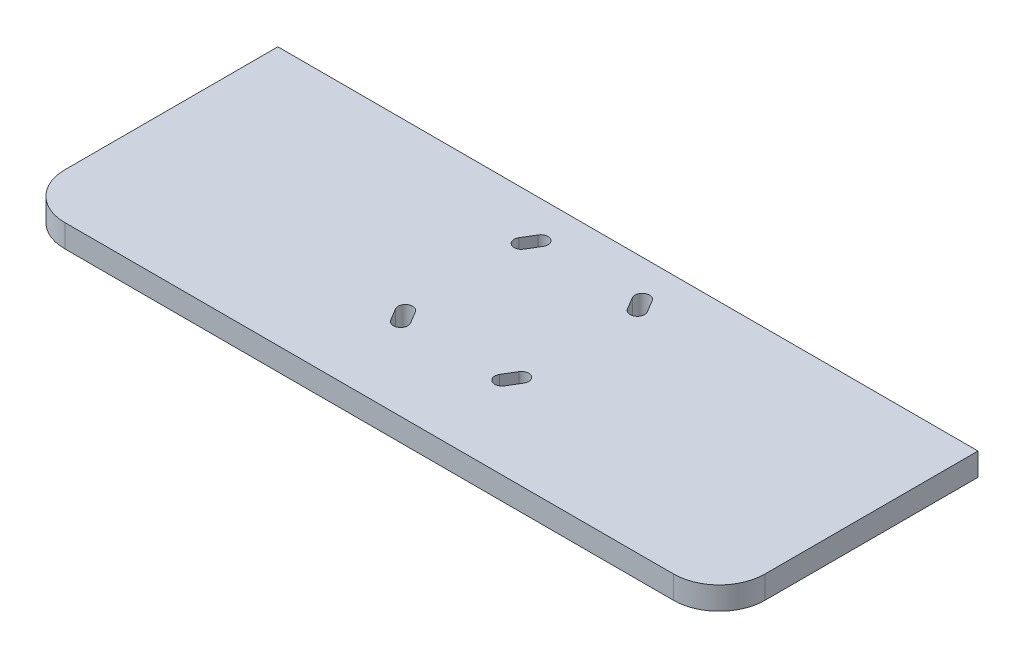
ISO-10303-21;
HEADER;
FILE_DESCRIPTION(('STEP AP214'),'2;1');
FILE_NAME('part.step','',(''),(''),'','','');
FILE_SCHEMA(('AUTOMOTIVE_DESIGN { 1 0 10303 214 1 1 1 1 }'));
ENDSEC;
DATA;
#1=APPLICATION_CONTEXT('core data for automotive mechanical design processes');
#2=APPLICATION_PROTOCOL_DEFINITION('international standard','automotive_design',2000,#1);
#3=PRODUCT_CONTEXT('',#1,'mechanical');
#4=PRODUCT('Part','Part','',(#3));
#5=PRODUCT_RELATED_PRODUCT_CATEGORY('part','',(#4));
#6=PRODUCT_DEFINITION_FORMATION('','',#4);
#7=PRODUCT_DEFINITION_CONTEXT('part definition',#1,'design');
#8=PRODUCT_DEFINITION('design','',#6,#7);
#9=PRODUCT_DEFINITION_SHAPE('','',#8);
#10=(LENGTH_UNIT() NAMED_UNIT(*) SI_UNIT(.MILLI.,.METRE.));
#11=(NAMED_UNIT(*) PLANE_ANGLE_UNIT() SI_UNIT($,.RADIAN.));
#12=(NAMED_UNIT(*) SI_UNIT($,.STERADIAN.) SOLID_ANGLE_UNIT());
#13=UNCERTAINTY_MEASURE_WITH_UNIT(LENGTH_MEASURE(1.E-05),#10,'distance_accuracy_value','');
#14=(GEOMETRIC_REPRESENTATION_CONTEXT(3) GLOBAL_UNCERTAINTY_ASSIGNED_CONTEXT((#13)) GLOBAL_UNIT_ASSIGNED_CONTEXT((#10,
#11,#12)) REPRESENTATION_CONTEXT('',''));
#15=CARTESIAN_POINT('',(0.,0.,0.));
#16=DIRECTION('',(0.,0.,1.));
#17=DIRECTION('',(1.,0.,0.));
#18=AXIS2_PLACEMENT_3D('',#15,#16,#17);
#19=CARTESIAN_POINT('',(230.,15.,70.));
#20=DIRECTION('',(-1.,0.,0.));
#21=DIRECTION('',(0.,0.,1.));
#22=AXIS2_PLACEMENT_3D('',#19,#20,#21);
#23=PLANE('',#22);
#24=DIRECTION('',(0.,0.,-1.));
#25=VECTOR('',#24,1.);
#26=CARTESIAN_POINT('',(230.,0.,70.));
#27=LINE('',#26,#25);
#28=CARTESIAN_POINT('',(230.,0.,70.));
#29=VERTEX_POINT('',#28);
#30=CARTESIAN_POINT('',(230.,0.,-70.));
#31=VERTEX_POINT('',#30);
#32=EDGE_CURVE('E201',#29,#31,#27,.T.);
#33=ORIENTED_EDGE('',*,*,#32,.T.);
#34=DIRECTION('',(0.,1.,0.));
#35=VECTOR('',#34,1.);
#36=CARTESIAN_POINT('',(230.,15.,-69.9999999999999));
#37=LINE('',#36,#35);
#38=CARTESIAN_POINT('',(230.,15.,-69.9999999999999));
#39=VERTEX_POINT('',#38);
#40=EDGE_CURVE('E49',#31,#39,#37,.T.);
#41=ORIENTED_EDGE('',*,*,#40,.T.);
#42=DIRECTION('',(0.,0.,-1.));
#43=VECTOR('',#42,1.);
#44=CARTESIAN_POINT('',(230.,15.,70.));
#45=LINE('',#44,#43);
#46=CARTESIAN_POINT('',(230.,15.,70.));
#47=VERTEX_POINT('',#46);
#48=EDGE_CURVE('E212',#47,#39,#45,.T.);
#49=ORIENTED_EDGE('',*,*,#48,.F.);
#50=DIRECTION('',(0.,-1.,0.));
#51=VECTOR('',#50,1.);
#52=CARTESIAN_POINT('',(230.,15.,70.));
#53=LINE('',#52,#51);
#54=EDGE_CURVE('E213',#47,#29,#53,.T.);
#55=ORIENTED_EDGE('',*,*,#54,.T.);
#56=EDGE_LOOP('',(#33,#41,#49,#55));
#57=FACE_BOUND('',#56,.T.);
#58=ADVANCED_FACE('F36',(#57),#23,.F.);
#59=CARTESIAN_POINT('',(-230.,15.,70.));
#60=DIRECTION('',(1.,0.,0.));
#61=DIRECTION('',(0.,0.,-1.));
#62=AXIS2_PLACEMENT_3D('',#59,#60,#61);
#63=PLANE('',#62);
#64=DIRECTION('',(0.,0.,1.));
#65=VECTOR('',#64,1.);
#66=CARTESIAN_POINT('',(-230.,15.,70.));
#67=LINE('',#66,#65);
#68=CARTESIAN_POINT('',(-230.,15.,-70.));
#69=VERTEX_POINT('',#68);
#70=CARTESIAN_POINT('',(-230.,15.,70.));
#71=VERTEX_POINT('',#70);
#72=EDGE_CURVE('E194',#69,#71,#67,.T.);
#73=ORIENTED_EDGE('',*,*,#72,.F.);
#74=DIRECTION('',(0.,-1.,0.));
#75=VECTOR('',#74,1.);
#76=CARTESIAN_POINT('',(-230.,15.,-70.));
#77=LINE('',#76,#75);
#78=CARTESIAN_POINT('',(-230.,0.,-70.));
#79=VERTEX_POINT('',#78);
#80=EDGE_CURVE('E182',#69,#79,#77,.T.);
#81=ORIENTED_EDGE('',*,*,#80,.T.);
#82=DIRECTION('',(0.,0.,1.));
#83=VECTOR('',#82,1.);
#84=CARTESIAN_POINT('',(-230.,0.,70.));
#85=LINE('',#84,#83);
#86=CARTESIAN_POINT('',(-230.,0.,70.));
#87=VERTEX_POINT('',#86);
#88=EDGE_CURVE('E192',#79,#87,#85,.T.);
#89=ORIENTED_EDGE('',*,*,#88,.T.);
#90=DIRECTION('',(0.,-1.,0.));
#91=VECTOR('',#90,1.);
#92=CARTESIAN_POINT('',(-230.,15.,70.));
#93=LINE('',#92,#91);
#94=EDGE_CURVE('E43',#71,#87,#93,.T.);
#95=ORIENTED_EDGE('',*,*,#94,.F.);
#96=EDGE_LOOP('',(#73,#81,#89,#95));
#97=FACE_BOUND('',#96,.T.);
#98=ADVANCED_FACE('F190',(#97),#63,.F.);
#99=CARTESIAN_POINT('',(-200.,15.,70.));
#100=DIRECTION('',(0.,-1.,0.));
#101=DIRECTION('',(0.,0.,-1.));
#102=AXIS2_PLACEMENT_3D('',#99,#100,#101);
#103=CYLINDRICAL_SURFACE('',#102,30.);
#104=CARTESIAN_POINT('',(-200.,0.,70.));
#105=DIRECTION('',(0.,1.,0.));
#106=DIRECTION('',(0.,0.,-1.));
#107=AXIS2_PLACEMENT_3D('',#104,#105,#106);
#108=CIRCLE('',#107,30.);
#109=CARTESIAN_POINT('',(-200.,0.,100.));
#110=VERTEX_POINT('',#109);
#111=EDGE_CURVE('E200',#87,#110,#108,.T.);
#112=ORIENTED_EDGE('',*,*,#111,.T.);
#113=DIRECTION('',(0.,-1.,0.));
#114=VECTOR('',#113,1.);
#115=CARTESIAN_POINT('',(-200.,15.,100.));
#116=LINE('',#115,#114);
#117=CARTESIAN_POINT('',(-200.,15.,100.));
#118=VERTEX_POINT('',#117);
#119=EDGE_CURVE('E220',#118,#110,#116,.T.);
#120=ORIENTED_EDGE('',*,*,#119,.F.);
#121=CARTESIAN_POINT('',(-200.,15.,70.));
#122=DIRECTION('',(0.,1.,0.));
#123=DIRECTION('',(0.,0.,-1.));
#124=AXIS2_PLACEMENT_3D('',#121,#122,#123);
#125=CIRCLE('',#124,30.);
#126=EDGE_CURVE('E226',#71,#118,#125,.T.);
#127=ORIENTED_EDGE('',*,*,#126,.F.);
#128=ORIENTED_EDGE('',*,*,#94,.T.);
#129=EDGE_LOOP('',(#112,#120,#127,#128));
#130=FACE_BOUND('',#129,.T.);
#131=ADVANCED_FACE('F224',(#130),#103,.T.);
#132=CARTESIAN_POINT('',(-200.,15.,100.));
#133=DIRECTION('',(0.,0.,-1.));
#134=DIRECTION('',(-1.,0.,0.));
#135=AXIS2_PLACEMENT_3D('',#132,#133,#134);
#136=PLANE('',#135);
#137=DIRECTION('',(1.,0.,0.));
#138=VECTOR('',#137,1.);
#139=CARTESIAN_POINT('',(-200.,0.,100.));
#140=LINE('',#139,#138);
#141=CARTESIAN_POINT('',(200.,0.,100.));
#142=VERTEX_POINT('',#141);
#143=EDGE_CURVE('E203',#110,#142,#140,.T.);
#144=ORIENTED_EDGE('',*,*,#143,.T.);
#145=DIRECTION('',(0.,-1.,0.));
#146=VECTOR('',#145,1.);
#147=CARTESIAN_POINT('',(200.,15.,100.));
#148=LINE('',#147,#146);
#149=CARTESIAN_POINT('',(200.,15.,100.));
#150=VERTEX_POINT('',#149);
#151=EDGE_CURVE('E216',#150,#142,#148,.T.);
#152=ORIENTED_EDGE('',*,*,#151,.F.);
#153=DIRECTION('',(1.,0.,0.));
#154=VECTOR('',#153,1.);
#155=CARTESIAN_POINT('',(-200.,15.,100.));
#156=LINE('',#155,#154);
#157=EDGE_CURVE('E229',#118,#150,#156,.T.);
#158=ORIENTED_EDGE('',*,*,#157,.F.);
#159=ORIENTED_EDGE('',*,*,#119,.T.);
#160=EDGE_LOOP('',(#144,#152,#158,#159));
#161=FACE_BOUND('',#160,.T.);
#162=ADVANCED_FACE('F430',(#161),#136,.F.);
#163=CARTESIAN_POINT('',(200.,15.,70.));
#164=DIRECTION('',(0.,-1.,0.));
#165=DIRECTION('',(0.,0.,-1.));
#166=AXIS2_PLACEMENT_3D('',#163,#164,#165);
#167=CYLINDRICAL_SURFACE('',#166,30.);
#168=CARTESIAN_POINT('',(200.,0.,70.));
#169=DIRECTION('',(0.,1.,0.));
#170=DIRECTION('',(0.,0.,1.));
#171=AXIS2_PLACEMENT_3D('',#168,#169,#170);
#172=CIRCLE('',#171,30.);
#173=EDGE_CURVE('E210',#142,#29,#172,.T.);
#174=ORIENTED_EDGE('',*,*,#173,.T.);
#175=ORIENTED_EDGE('',*,*,#54,.F.);
#176=CARTESIAN_POINT('',(200.,15.,70.));
#177=DIRECTION('',(0.,1.,0.));
#178=DIRECTION('',(0.,0.,1.));
#179=AXIS2_PLACEMENT_3D('',#176,#177,#178);
#180=CIRCLE('',#179,30.);
#181=EDGE_CURVE('E217',#150,#47,#180,.T.);
#182=ORIENTED_EDGE('',*,*,#181,.F.);
#183=ORIENTED_EDGE('',*,*,#151,.T.);
#184=EDGE_LOOP('',(#174,#175,#182,#183));
#185=FACE_BOUND('',#184,.T.);
#186=ADVANCED_FACE('F241',(#185),#167,.T.);
#187=CARTESIAN_POINT('',(-200.,15.,70.));
#188=DIRECTION('',(0.,-1.,0.));
#189=DIRECTION('',(0.,0.,-1.));
#190=AXIS2_PLACEMENT_3D('',#187,#188,#189);
#191=PLANE('',#190);
#192=DIRECTION('',(0.514495755427524,0.,0.857492925712546));
#193=VECTOR('',#192,1.);
#194=CARTESIAN_POINT('',(-42.1838100587061,15.,40.5502860352223));
#195=LINE('',#194,#193);
#196=CARTESIAN_POINT('',(-42.1838100587061,15.,40.5502860352223));
#197=VERTEX_POINT('',#196);
#198=CARTESIAN_POINT('',(-37.4213100587049,15.,48.4877860352244));
#199=VERTEX_POINT('',#198);
#200=EDGE_CURVE('E260',#197,#199,#195,.T.);
#201=ORIENTED_EDGE('',*,*,#200,.F.);
#202=CARTESIAN_POINT('',(-38.1000000000001,15.,38.0999999999987));
#203=DIRECTION('',(0.,1.,0.));
#204=DIRECTION('',(0.,0.,1.));
#205=AXIS2_PLACEMENT_3D('',#202,#203,#204);
#206=CIRCLE('',#205,4.7625);
#207=CARTESIAN_POINT('',(-34.0161899412941,15.,35.6497139647752));
#208=VERTEX_POINT('',#207);
#209=EDGE_CURVE('E57',#208,#197,#206,.T.);
#210=ORIENTED_EDGE('',*,*,#209,.F.);
#211=DIRECTION('',(-0.514495755427524,0.,-0.857492925712546));
#212=VECTOR('',#211,1.);
#213=CARTESIAN_POINT('',(-34.0161899412941,15.,35.6497139647752));
#214=LINE('',#213,#212);
#215=CARTESIAN_POINT('',(-29.2536899412929,15.,43.5872139647772));
#216=VERTEX_POINT('',#215);
#217=EDGE_CURVE('E253',#216,#208,#214,.T.);
#218=ORIENTED_EDGE('',*,*,#217,.F.);
#219=CARTESIAN_POINT('',(-33.3374999999989,15.,46.0375000000008));
#220=DIRECTION('',(0.,1.,0.));
#221=DIRECTION('',(0.,0.,1.));
#222=AXIS2_PLACEMENT_3D('',#219,#220,#221);
#223=CIRCLE('',#222,4.7625);
#224=EDGE_CURVE('E257',#199,#216,#223,.T.);
#225=ORIENTED_EDGE('',*,*,#224,.F.);
#226=EDGE_LOOP('',(#201,#210,#218,#225));
#227=FACE_BOUND('',#226,.T.);
#228=DIRECTION('',(-0.51449575542756,0.,-0.857492925712524));
#229=VECTOR('',#228,1.);
#230=CARTESIAN_POINT('',(42.1838100587054,15.,-40.5502860352235));
#231=LINE('',#230,#229);
#232=CARTESIAN_POINT('',(42.1838100587054,15.,-40.5502860352235));
#233=VERTEX_POINT('',#232);
#234=CARTESIAN_POINT('',(37.4213100587051,15.,-48.4877860352233));
#235=VERTEX_POINT('',#234);
#236=EDGE_CURVE('E355',#233,#235,#231,.T.);
#237=ORIENTED_EDGE('',*,*,#236,.F.);
#238=CARTESIAN_POINT('',(38.0999999999997,15.,-38.0999999999999));
#239=DIRECTION('',(0.,1.,0.));
#240=DIRECTION('',(0.,0.,1.));
#241=AXIS2_PLACEMENT_3D('',#238,#239,#240);
#242=CIRCLE('',#241,4.76249999999982);
#243=CARTESIAN_POINT('',(34.0161899412939,15.,-35.6497139647762));
#244=VERTEX_POINT('',#243);
#245=EDGE_CURVE('E358',#244,#233,#242,.T.);
#246=ORIENTED_EDGE('',*,*,#245,.F.);
#247=DIRECTION('',(0.51449575542756,0.,0.857492925712524));
#248=VECTOR('',#247,1.);
#249=CARTESIAN_POINT('',(34.0161899412939,15.,-35.6497139647762));
#250=LINE('',#249,#248);
#251=CARTESIAN_POINT('',(29.2536899412936,15.,-43.587213964776));
#252=VERTEX_POINT('',#251);
#253=EDGE_CURVE('E348',#252,#244,#250,.T.);
#254=ORIENTED_EDGE('',*,*,#253,.F.);
#255=CARTESIAN_POINT('',(33.3374999999994,15.,-46.0374999999997));
#256=DIRECTION('',(0.,1.,0.));
#257=DIRECTION('',(0.,0.,1.));
#258=AXIS2_PLACEMENT_3D('',#255,#256,#257);
#259=CIRCLE('',#258,4.76249999999982);
#260=EDGE_CURVE('E352',#235,#252,#259,.T.);
#261=ORIENTED_EDGE('',*,*,#260,.F.);
#262=EDGE_LOOP('',(#237,#246,#254,#261));
#263=FACE_BOUND('',#262,.T.);
#264=DIRECTION('',(0.514495755427523,0.,-0.857492925712546));
#265=VECTOR('',#264,1.);
#266=CARTESIAN_POINT('',(-34.0161899412935,15.,-35.6497139647762));
#267=LINE('',#266,#265);
#268=CARTESIAN_POINT('',(-34.0161899412935,15.,-35.6497139647762));
#269=VERTEX_POINT('',#268);
#270=CARTESIAN_POINT('',(-29.2536899412935,15.,-43.5872139647762));
#271=VERTEX_POINT('',#270);
#272=EDGE_CURVE('E293',#269,#271,#267,.T.);
#273=ORIENTED_EDGE('',*,*,#272,.F.);
#274=CARTESIAN_POINT('',(-38.0999999999995,15.,-38.0999999999998));
#275=DIRECTION('',(0.,1.,0.));
#276=DIRECTION('',(0.,0.,-1.));
#277=AXIS2_PLACEMENT_3D('',#274,#275,#276);
#278=CIRCLE('',#277,4.76250000000001);
#279=CARTESIAN_POINT('',(-42.1838100587055,15.,-40.5502860352233));
#280=VERTEX_POINT('',#279);
#281=EDGE_CURVE('E296',#280,#269,#278,.T.);
#282=ORIENTED_EDGE('',*,*,#281,.F.);
#283=DIRECTION('',(-0.514495755427523,0.,0.857492925712546));
#284=VECTOR('',#283,1.);
#285=CARTESIAN_POINT('',(-42.1838100587055,15.,-40.5502860352233));
#286=LINE('',#285,#284);
#287=CARTESIAN_POINT('',(-37.4213100587055,15.,-48.4877860352234));
#288=VERTEX_POINT('',#287);
#289=EDGE_CURVE('E286',#288,#280,#286,.T.);
#290=ORIENTED_EDGE('',*,*,#289,.F.);
#291=CARTESIAN_POINT('',(-33.3374999999995,15.,-46.0374999999998));
#292=DIRECTION('',(0.,1.,0.));
#293=DIRECTION('',(0.,0.,-1.));
#294=AXIS2_PLACEMENT_3D('',#291,#292,#293);
#295=CIRCLE('',#294,4.76250000000001);
#296=EDGE_CURVE('E290',#271,#288,#295,.T.);
#297=ORIENTED_EDGE('',*,*,#296,.F.);
#298=EDGE_LOOP('',(#273,#282,#290,#297));
#299=FACE_BOUND('',#298,.T.);
#300=DIRECTION('',(-0.514495755427526,0.,0.857492925712545));
#301=VECTOR('',#300,1.);
#302=CARTESIAN_POINT('',(34.0161899412934,15.,35.6497139647765));
#303=LINE('',#302,#301);
#304=CARTESIAN_POINT('',(34.0161899412934,15.,35.6497139647764));
#305=VERTEX_POINT('',#304);
#306=CARTESIAN_POINT('',(29.2536899412937,15.,43.587213964776));
#307=VERTEX_POINT('',#306);
#308=EDGE_CURVE('E325',#305,#307,#303,.T.);
#309=ORIENTED_EDGE('',*,*,#308,.F.);
#310=CARTESIAN_POINT('',(38.0999999999994,15.,38.1));
#311=DIRECTION('',(0.,1.,0.));
#312=DIRECTION('',(0.,0.,-1.));
#313=AXIS2_PLACEMENT_3D('',#310,#311,#312);
#314=CIRCLE('',#313,4.76249999999992);
#315=CARTESIAN_POINT('',(42.1838100587053,15.,40.5502860352236));
#316=VERTEX_POINT('',#315);
#317=EDGE_CURVE('E285',#316,#305,#314,.T.);
#318=ORIENTED_EDGE('',*,*,#317,.F.);
#319=DIRECTION('',(0.514495755427526,0.,-0.857492925712545));
#320=VECTOR('',#319,1.);
#321=CARTESIAN_POINT('',(42.1838100587053,15.,40.5502860352236));
#322=LINE('',#321,#320);
#323=CARTESIAN_POINT('',(37.4213100587056,15.,48.4877860352231));
#324=VERTEX_POINT('',#323);
#325=EDGE_CURVE('E318',#324,#316,#322,.T.);
#326=ORIENTED_EDGE('',*,*,#325,.F.);
#327=CARTESIAN_POINT('',(33.3374999999997,15.,46.0374999999995));
#328=DIRECTION('',(0.,1.,0.));
#329=DIRECTION('',(0.,0.,-1.));
#330=AXIS2_PLACEMENT_3D('',#327,#328,#329);
#331=CIRCLE('',#330,4.76249999999992);
#332=EDGE_CURVE('E322',#307,#324,#331,.T.);
#333=ORIENTED_EDGE('',*,*,#332,.F.);
#334=EDGE_LOOP('',(#309,#318,#326,#333));
#335=FACE_BOUND('',#334,.T.);
#336=ORIENTED_EDGE('',*,*,#48,.T.);
#337=DIRECTION('',(-1.,0.,0.));
#338=VECTOR('',#337,1.);
#339=CARTESIAN_POINT('',(-200.,15.,-70.));
#340=LINE('',#339,#338);
#341=EDGE_CURVE('E360',#39,#69,#340,.T.);
#342=ORIENTED_EDGE('',*,*,#341,.T.);
#343=ORIENTED_EDGE('',*,*,#72,.T.);
#344=ORIENTED_EDGE('',*,*,#126,.T.);
#345=ORIENTED_EDGE('',*,*,#157,.T.);
#346=ORIENTED_EDGE('',*,*,#181,.T.);
#347=EDGE_LOOP('',(#336,#342,#343,#344,#345,#346));
#348=FACE_BOUND('',#347,.T.);
#349=ADVANCED_FACE('F237',(#227,#263,#299,#335,#348),#191,.F.);
#350=CARTESIAN_POINT('',(-200.,0.,70.));
#351=DIRECTION('',(0.,-1.,0.));
#352=DIRECTION('',(0.,0.,-1.));
#353=AXIS2_PLACEMENT_3D('',#350,#351,#352);
#354=PLANE('',#353);
#355=DIRECTION('',(-1.,0.,0.));
#356=VECTOR('',#355,1.);
#357=CARTESIAN_POINT('',(-200.,0.,-70.));
#358=LINE('',#357,#356);
#359=EDGE_CURVE('E11',#31,#79,#358,.T.);
#360=ORIENTED_EDGE('',*,*,#359,.F.);
#361=ORIENTED_EDGE('',*,*,#32,.F.);
#362=ORIENTED_EDGE('',*,*,#173,.F.);
#363=ORIENTED_EDGE('',*,*,#143,.F.);
#364=ORIENTED_EDGE('',*,*,#111,.F.);
#365=ORIENTED_EDGE('',*,*,#88,.F.);
#366=EDGE_LOOP('',(#360,#361,#362,#363,#364,#365));
#367=FACE_BOUND('',#366,.T.);
#368=CARTESIAN_POINT('',(-38.1000000000001,0.,38.0999999999987));
#369=DIRECTION('',(0.,1.,0.));
#370=DIRECTION('',(0.,0.,1.));
#371=AXIS2_PLACEMENT_3D('',#368,#369,#370);
#372=CIRCLE('',#371,4.7625);
#373=CARTESIAN_POINT('',(-34.0161899412941,0.,35.6497139647752));
#374=VERTEX_POINT('',#373);
#375=CARTESIAN_POINT('',(-42.1838100587061,0.,40.5502860352223));
#376=VERTEX_POINT('',#375);
#377=EDGE_CURVE('E256',#374,#376,#372,.T.);
#378=ORIENTED_EDGE('',*,*,#377,.T.);
#379=DIRECTION('',(0.514495755427524,0.,0.857492925712546));
#380=VECTOR('',#379,1.);
#381=CARTESIAN_POINT('',(-42.1838100587061,0.,40.5502860352223));
#382=LINE('',#381,#380);
#383=CARTESIAN_POINT('',(-37.4213100587049,0.,48.4877860352244));
#384=VERTEX_POINT('',#383);
#385=EDGE_CURVE('E270',#376,#384,#382,.T.);
#386=ORIENTED_EDGE('',*,*,#385,.T.);
#387=CARTESIAN_POINT('',(-33.3374999999989,0.,46.0375000000008));
#388=DIRECTION('',(0.,1.,0.));
#389=DIRECTION('',(0.,0.,1.));
#390=AXIS2_PLACEMENT_3D('',#387,#388,#389);
#391=CIRCLE('',#390,4.7625);
#392=CARTESIAN_POINT('',(-29.2536899412929,0.,43.5872139647772));
#393=VERTEX_POINT('',#392);
#394=EDGE_CURVE('E267',#384,#393,#391,.T.);
#395=ORIENTED_EDGE('',*,*,#394,.T.);
#396=DIRECTION('',(-0.514495755427524,0.,-0.857492925712546));
#397=VECTOR('',#396,1.);
#398=CARTESIAN_POINT('',(-34.0161899412941,0.,35.6497139647752));
#399=LINE('',#398,#397);
#400=EDGE_CURVE('E248',#393,#374,#399,.T.);
#401=ORIENTED_EDGE('',*,*,#400,.T.);
#402=EDGE_LOOP('',(#378,#386,#395,#401));
#403=FACE_BOUND('',#402,.T.);
#404=CARTESIAN_POINT('',(38.0999999999997,0.,-38.0999999999999));
#405=DIRECTION('',(0.,1.,0.));
#406=DIRECTION('',(0.,0.,1.));
#407=AXIS2_PLACEMENT_3D('',#404,#405,#406);
#408=CIRCLE('',#407,4.76249999999982);
#409=CARTESIAN_POINT('',(34.0161899412939,0.,-35.6497139647762));
#410=VERTEX_POINT('',#409);
#411=CARTESIAN_POINT('',(42.1838100587054,0.,-40.5502860352235));
#412=VERTEX_POINT('',#411);
#413=EDGE_CURVE('E351',#410,#412,#408,.T.);
#414=ORIENTED_EDGE('',*,*,#413,.T.);
#415=DIRECTION('',(-0.51449575542756,0.,-0.857492925712524));
#416=VECTOR('',#415,1.);
#417=CARTESIAN_POINT('',(42.1838100587054,0.,-40.5502860352235));
#418=LINE('',#417,#416);
#419=CARTESIAN_POINT('',(37.4213100587051,0.,-48.4877860352233));
#420=VERTEX_POINT('',#419);
#421=EDGE_CURVE('E366',#412,#420,#418,.T.);
#422=ORIENTED_EDGE('',*,*,#421,.T.);
#423=CARTESIAN_POINT('',(33.3374999999994,0.,-46.0374999999997));
#424=DIRECTION('',(0.,1.,0.));
#425=DIRECTION('',(0.,0.,1.));
#426=AXIS2_PLACEMENT_3D('',#423,#424,#425);
#427=CIRCLE('',#426,4.76249999999982);
#428=CARTESIAN_POINT('',(29.2536899412936,0.,-43.587213964776));
#429=VERTEX_POINT('',#428);
#430=EDGE_CURVE('E363',#420,#429,#427,.T.);
#431=ORIENTED_EDGE('',*,*,#430,.T.);
#432=DIRECTION('',(0.51449575542756,0.,0.857492925712524));
#433=VECTOR('',#432,1.);
#434=CARTESIAN_POINT('',(34.0161899412939,0.,-35.6497139647762));
#435=LINE('',#434,#433);
#436=EDGE_CURVE('E343',#429,#410,#435,.T.);
#437=ORIENTED_EDGE('',*,*,#436,.T.);
#438=EDGE_LOOP('',(#414,#422,#431,#437));
#439=FACE_BOUND('',#438,.T.);
#440=CARTESIAN_POINT('',(-38.0999999999995,0.,-38.0999999999998));
#441=DIRECTION('',(0.,1.,0.));
#442=DIRECTION('',(0.,0.,-1.));
#443=AXIS2_PLACEMENT_3D('',#440,#441,#442);
#444=CIRCLE('',#443,4.76250000000001);
#445=CARTESIAN_POINT('',(-42.1838100587055,0.,-40.5502860352233));
#446=VERTEX_POINT('',#445);
#447=CARTESIAN_POINT('',(-34.0161899412935,0.,-35.6497139647762));
#448=VERTEX_POINT('',#447);
#449=EDGE_CURVE('E289',#446,#448,#444,.T.);
#450=ORIENTED_EDGE('',*,*,#449,.T.);
#451=DIRECTION('',(0.514495755427523,0.,-0.857492925712546));
#452=VECTOR('',#451,1.);
#453=CARTESIAN_POINT('',(-34.0161899412935,0.,-35.6497139647762));
#454=LINE('',#453,#452);
#455=CARTESIAN_POINT('',(-29.2536899412935,0.,-43.5872139647762));
#456=VERTEX_POINT('',#455);
#457=EDGE_CURVE('E304',#448,#456,#454,.T.);
#458=ORIENTED_EDGE('',*,*,#457,.T.);
#459=CARTESIAN_POINT('',(-33.3374999999995,0.,-46.0374999999998));
#460=DIRECTION('',(0.,1.,0.));
#461=DIRECTION('',(0.,0.,-1.));
#462=AXIS2_PLACEMENT_3D('',#459,#460,#461);
#463=CIRCLE('',#462,4.76250000000001);
#464=CARTESIAN_POINT('',(-37.4213100587055,0.,-48.4877860352234));
#465=VERTEX_POINT('',#464);
#466=EDGE_CURVE('E301',#456,#465,#463,.T.);
#467=ORIENTED_EDGE('',*,*,#466,.T.);
#468=DIRECTION('',(-0.514495755427523,0.,0.857492925712546));
#469=VECTOR('',#468,1.);
#470=CARTESIAN_POINT('',(-42.1838100587055,0.,-40.5502860352233));
#471=LINE('',#470,#469);
#472=EDGE_CURVE('E279',#465,#446,#471,.T.);
#473=ORIENTED_EDGE('',*,*,#472,.T.);
#474=EDGE_LOOP('',(#450,#458,#467,#473));
#475=FACE_BOUND('',#474,.T.);
#476=CARTESIAN_POINT('',(38.0999999999994,0.,38.1));
#477=DIRECTION('',(0.,1.,0.));
#478=DIRECTION('',(0.,0.,-1.));
#479=AXIS2_PLACEMENT_3D('',#476,#477,#478);
#480=CIRCLE('',#479,4.76249999999992);
#481=CARTESIAN_POINT('',(42.1838100587053,0.,40.5502860352236));
#482=VERTEX_POINT('',#481);
#483=CARTESIAN_POINT('',(34.0161899412934,0.,35.6497139647765));
#484=VERTEX_POINT('',#483);
#485=EDGE_CURVE('E321',#482,#484,#480,.T.);
#486=ORIENTED_EDGE('',*,*,#485,.T.);
#487=DIRECTION('',(-0.514495755427526,0.,0.857492925712545));
#488=VECTOR('',#487,1.);
#489=CARTESIAN_POINT('',(34.0161899412934,0.,35.6497139647765));
#490=LINE('',#489,#488);
#491=CARTESIAN_POINT('',(29.2536899412937,0.,43.587213964776));
#492=VERTEX_POINT('',#491);
#493=EDGE_CURVE('E334',#484,#492,#490,.T.);
#494=ORIENTED_EDGE('',*,*,#493,.T.);
#495=CARTESIAN_POINT('',(33.3374999999997,0.,46.0374999999995));
#496=DIRECTION('',(0.,1.,0.));
#497=DIRECTION('',(0.,0.,-1.));
#498=AXIS2_PLACEMENT_3D('',#495,#496,#497);
#499=CIRCLE('',#498,4.76249999999992);
#500=CARTESIAN_POINT('',(37.4213100587056,0.,48.4877860352231));
#501=VERTEX_POINT('',#500);
#502=EDGE_CURVE('E331',#492,#501,#499,.T.);
#503=ORIENTED_EDGE('',*,*,#502,.T.);
#504=DIRECTION('',(0.514495755427526,0.,-0.857492925712545));
#505=VECTOR('',#504,1.);
#506=CARTESIAN_POINT('',(42.1838100587053,0.,40.5502860352236));
#507=LINE('',#506,#505);
#508=EDGE_CURVE('E313',#501,#482,#507,.T.);
#509=ORIENTED_EDGE('',*,*,#508,.T.);
#510=EDGE_LOOP('',(#486,#494,#503,#509));
#511=FACE_BOUND('',#510,.T.);
#512=ADVANCED_FACE('F197',(#367,#403,#439,#475,#511),#354,.T.);
#513=CARTESIAN_POINT('',(38.0999999999994,0.,38.1));
#514=DIRECTION('',(0.,1.,0.));
#515=DIRECTION('',(0.,0.,1.));
#516=AXIS2_PLACEMENT_3D('',#513,#514,#515);
#517=CYLINDRICAL_SURFACE('',#516,4.76249999999992);
#518=ORIENTED_EDGE('',*,*,#317,.T.);
#519=DIRECTION('',(0.,1.,0.));
#520=VECTOR('',#519,1.);
#521=CARTESIAN_POINT('',(34.0161899412934,0.,35.6497139647765));
#522=LINE('',#521,#520);
#523=EDGE_CURVE('E309',#484,#305,#522,.T.);
#524=ORIENTED_EDGE('',*,*,#523,.F.);
#525=ORIENTED_EDGE('',*,*,#485,.F.);
#526=DIRECTION('',(0.,1.,0.));
#527=VECTOR('',#526,1.);
#528=CARTESIAN_POINT('',(42.1838100587053,0.,40.5502860352236));
#529=LINE('',#528,#527);
#530=EDGE_CURVE('E264',#482,#316,#529,.T.);
#531=ORIENTED_EDGE('',*,*,#530,.T.);
#532=EDGE_LOOP('',(#518,#524,#525,#531));
#533=FACE_BOUND('',#532,.T.);
#534=ADVANCED_FACE('F409',(#533),#517,.F.);
#535=CARTESIAN_POINT('',(42.1838100587053,0.,40.5502860352236));
#536=DIRECTION('',(0.857492925712545,0.,0.514495755427526));
#537=DIRECTION('',(0.514495755427526,0.,-0.857492925712545));
#538=AXIS2_PLACEMENT_3D('',#535,#536,#537);
#539=PLANE('',#538);
#540=ORIENTED_EDGE('',*,*,#325,.T.);
#541=ORIENTED_EDGE('',*,*,#530,.F.);
#542=ORIENTED_EDGE('',*,*,#508,.F.);
#543=DIRECTION('',(0.,1.,0.));
#544=VECTOR('',#543,1.);
#545=CARTESIAN_POINT('',(37.4213100587056,0.,48.4877860352231));
#546=LINE('',#545,#544);
#547=EDGE_CURVE('E315',#501,#324,#546,.T.);
#548=ORIENTED_EDGE('',*,*,#547,.T.);
#549=EDGE_LOOP('',(#540,#541,#542,#548));
#550=FACE_BOUND('',#549,.T.);
#551=ADVANCED_FACE('F412',(#550),#539,.F.);
#552=CARTESIAN_POINT('',(33.3374999999997,0.,46.0374999999995));
#553=DIRECTION('',(0.,1.,0.));
#554=DIRECTION('',(0.,0.,1.));
#555=AXIS2_PLACEMENT_3D('',#552,#553,#554);
#556=CYLINDRICAL_SURFACE('',#555,4.76249999999992);
#557=ORIENTED_EDGE('',*,*,#332,.T.);
#558=ORIENTED_EDGE('',*,*,#547,.F.);
#559=ORIENTED_EDGE('',*,*,#502,.F.);
#560=DIRECTION('',(0.,1.,0.));
#561=VECTOR('',#560,1.);
#562=CARTESIAN_POINT('',(29.2536899412937,0.,43.587213964776));
#563=LINE('',#562,#561);
#564=EDGE_CURVE('E312',#492,#307,#563,.T.);
#565=ORIENTED_EDGE('',*,*,#564,.T.);
#566=EDGE_LOOP('',(#557,#558,#559,#565));
#567=FACE_BOUND('',#566,.T.);
#568=ADVANCED_FACE('F414',(#567),#556,.F.);
#569=CARTESIAN_POINT('',(34.0161899412934,0.,35.6497139647765));
#570=DIRECTION('',(-0.857492925712545,0.,-0.514495755427526));
#571=DIRECTION('',(-0.514495755427526,0.,0.857492925712545));
#572=AXIS2_PLACEMENT_3D('',#569,#570,#571);
#573=PLANE('',#572);
#574=ORIENTED_EDGE('',*,*,#308,.T.);
#575=ORIENTED_EDGE('',*,*,#564,.F.);
#576=ORIENTED_EDGE('',*,*,#493,.F.);
#577=ORIENTED_EDGE('',*,*,#523,.T.);
#578=EDGE_LOOP('',(#574,#575,#576,#577));
#579=FACE_BOUND('',#578,.T.);
#580=ADVANCED_FACE('F405',(#579),#573,.F.);
#581=CARTESIAN_POINT('',(-38.0999999999995,0.,-38.0999999999998));
#582=DIRECTION('',(0.,1.,0.));
#583=DIRECTION('',(0.,0.,1.));
#584=AXIS2_PLACEMENT_3D('',#581,#582,#583);
#585=CYLINDRICAL_SURFACE('',#584,4.76250000000001);
#586=ORIENTED_EDGE('',*,*,#281,.T.);
#587=DIRECTION('',(0.,1.,0.));
#588=VECTOR('',#587,1.);
#589=CARTESIAN_POINT('',(-34.0161899412935,0.,-35.6497139647762));
#590=LINE('',#589,#588);
#591=EDGE_CURVE('E275',#448,#269,#590,.T.);
#592=ORIENTED_EDGE('',*,*,#591,.F.);
#593=ORIENTED_EDGE('',*,*,#449,.F.);
#594=DIRECTION('',(0.,1.,0.));
#595=VECTOR('',#594,1.);
#596=CARTESIAN_POINT('',(-42.1838100587055,0.,-40.5502860352233));
#597=LINE('',#596,#595);
#598=EDGE_CURVE('E283',#446,#280,#597,.T.);
#599=ORIENTED_EDGE('',*,*,#598,.T.);
#600=EDGE_LOOP('',(#586,#592,#593,#599));
#601=FACE_BOUND('',#600,.T.);
#602=ADVANCED_FACE('F540',(#601),#585,.F.);
#603=CARTESIAN_POINT('',(-42.1838100587055,0.,-40.5502860352233));
#604=DIRECTION('',(-0.857492925712546,0.,-0.514495755427523));
#605=DIRECTION('',(-0.514495755427523,0.,0.857492925712546));
#606=AXIS2_PLACEMENT_3D('',#603,#604,#605);
#607=PLANE('',#606);
#608=ORIENTED_EDGE('',*,*,#289,.T.);
#609=ORIENTED_EDGE('',*,*,#598,.F.);
#610=ORIENTED_EDGE('',*,*,#472,.F.);
#611=DIRECTION('',(0.,1.,0.));
#612=VECTOR('',#611,1.);
#613=CARTESIAN_POINT('',(-37.4213100587055,0.,-48.4877860352234));
#614=LINE('',#613,#612);
#615=EDGE_CURVE('E281',#465,#288,#614,.T.);
#616=ORIENTED_EDGE('',*,*,#615,.T.);
#617=EDGE_LOOP('',(#608,#609,#610,#616));
#618=FACE_BOUND('',#617,.T.);
#619=ADVANCED_FACE('F532',(#618),#607,.F.);
#620=CARTESIAN_POINT('',(-33.3374999999995,0.,-46.0374999999998));
#621=DIRECTION('',(0.,1.,0.));
#622=DIRECTION('',(0.,0.,1.));
#623=AXIS2_PLACEMENT_3D('',#620,#621,#622);
#624=CYLINDRICAL_SURFACE('',#623,4.76250000000001);
#625=ORIENTED_EDGE('',*,*,#296,.T.);
#626=ORIENTED_EDGE('',*,*,#615,.F.);
#627=ORIENTED_EDGE('',*,*,#466,.F.);
#628=DIRECTION('',(0.,1.,0.));
#629=VECTOR('',#628,1.);
#630=CARTESIAN_POINT('',(-29.2536899412935,0.,-43.5872139647762));
#631=LINE('',#630,#629);
#632=EDGE_CURVE('E278',#456,#271,#631,.T.);
#633=ORIENTED_EDGE('',*,*,#632,.T.);
#634=EDGE_LOOP('',(#625,#626,#627,#633));
#635=FACE_BOUND('',#634,.T.);
#636=ADVANCED_FACE('F524',(#635),#624,.F.);
#637=CARTESIAN_POINT('',(-34.0161899412935,0.,-35.6497139647762));
#638=DIRECTION('',(0.857492925712546,0.,0.514495755427523));
#639=DIRECTION('',(0.514495755427523,0.,-0.857492925712546));
#640=AXIS2_PLACEMENT_3D('',#637,#638,#639);
#641=PLANE('',#640);
#642=ORIENTED_EDGE('',*,*,#272,.T.);
#643=ORIENTED_EDGE('',*,*,#632,.F.);
#644=ORIENTED_EDGE('',*,*,#457,.F.);
#645=ORIENTED_EDGE('',*,*,#591,.T.);
#646=EDGE_LOOP('',(#642,#643,#644,#645));
#647=FACE_BOUND('',#646,.T.);
#648=ADVANCED_FACE('F517',(#647),#641,.F.);
#649=CARTESIAN_POINT('',(38.0999999999997,0.,-38.0999999999999));
#650=DIRECTION('',(0.,1.,0.));
#651=DIRECTION('',(0.,0.,1.));
#652=AXIS2_PLACEMENT_3D('',#649,#650,#651);
#653=CYLINDRICAL_SURFACE('',#652,4.76249999999982);
#654=ORIENTED_EDGE('',*,*,#245,.T.);
#655=DIRECTION('',(0.,1.,0.));
#656=VECTOR('',#655,1.);
#657=CARTESIAN_POINT('',(42.1838100587054,0.,-40.5502860352235));
#658=LINE('',#657,#656);
#659=EDGE_CURVE('E339',#412,#233,#658,.T.);
#660=ORIENTED_EDGE('',*,*,#659,.F.);
#661=ORIENTED_EDGE('',*,*,#413,.F.);
#662=DIRECTION('',(0.,1.,0.));
#663=VECTOR('',#662,1.);
#664=CARTESIAN_POINT('',(34.0161899412939,0.,-35.6497139647762));
#665=LINE('',#664,#663);
#666=EDGE_CURVE('E298',#410,#244,#665,.T.);
#667=ORIENTED_EDGE('',*,*,#666,.T.);
#668=EDGE_LOOP('',(#654,#660,#661,#667));
#669=FACE_BOUND('',#668,.T.);
#670=ADVANCED_FACE('F378',(#669),#653,.F.);
#671=CARTESIAN_POINT('',(34.0161899412939,0.,-35.6497139647762));
#672=DIRECTION('',(-0.857492925712524,0.,0.51449575542756));
#673=DIRECTION('',(0.51449575542756,0.,0.857492925712524));
#674=AXIS2_PLACEMENT_3D('',#671,#672,#673);
#675=PLANE('',#674);
#676=ORIENTED_EDGE('',*,*,#253,.T.);
#677=ORIENTED_EDGE('',*,*,#666,.F.);
#678=ORIENTED_EDGE('',*,*,#436,.F.);
#679=DIRECTION('',(0.,1.,0.));
#680=VECTOR('',#679,1.);
#681=CARTESIAN_POINT('',(29.2536899412936,0.,-43.587213964776));
#682=LINE('',#681,#680);
#683=EDGE_CURVE('E345',#429,#252,#682,.T.);
#684=ORIENTED_EDGE('',*,*,#683,.T.);
#685=EDGE_LOOP('',(#676,#677,#678,#684));
#686=FACE_BOUND('',#685,.T.);
#687=ADVANCED_FACE('F389',(#686),#675,.F.);
#688=CARTESIAN_POINT('',(33.3374999999994,0.,-46.0374999999997));
#689=DIRECTION('',(0.,1.,0.));
#690=DIRECTION('',(0.,0.,1.));
#691=AXIS2_PLACEMENT_3D('',#688,#689,#690);
#692=CYLINDRICAL_SURFACE('',#691,4.76249999999982);
#693=ORIENTED_EDGE('',*,*,#260,.T.);
#694=ORIENTED_EDGE('',*,*,#683,.F.);
#695=ORIENTED_EDGE('',*,*,#430,.F.);
#696=DIRECTION('',(0.,1.,0.));
#697=VECTOR('',#696,1.);
#698=CARTESIAN_POINT('',(37.4213100587051,0.,-48.4877860352233));
#699=LINE('',#698,#697);
#700=EDGE_CURVE('E342',#420,#235,#699,.T.);
#701=ORIENTED_EDGE('',*,*,#700,.T.);
#702=EDGE_LOOP('',(#693,#694,#695,#701));
#703=FACE_BOUND('',#702,.T.);
#704=ADVANCED_FACE('F386',(#703),#692,.F.);
#705=CARTESIAN_POINT('',(42.1838100587054,0.,-40.5502860352235));
#706=DIRECTION('',(0.857492925712524,0.,-0.51449575542756));
#707=DIRECTION('',(-0.51449575542756,0.,-0.857492925712524));
#708=AXIS2_PLACEMENT_3D('',#705,#706,#707);
#709=PLANE('',#708);
#710=ORIENTED_EDGE('',*,*,#236,.T.);
#711=ORIENTED_EDGE('',*,*,#700,.F.);
#712=ORIENTED_EDGE('',*,*,#421,.F.);
#713=ORIENTED_EDGE('',*,*,#659,.T.);
#714=EDGE_LOOP('',(#710,#711,#712,#713));
#715=FACE_BOUND('',#714,.T.);
#716=ADVANCED_FACE('F383',(#715),#709,.F.);
#717=CARTESIAN_POINT('',(-38.1000000000001,0.,38.0999999999987));
#718=DIRECTION('',(0.,1.,0.));
#719=DIRECTION('',(0.,0.,1.));
#720=AXIS2_PLACEMENT_3D('',#717,#718,#719);
#721=CYLINDRICAL_SURFACE('',#720,4.7625);
#722=ORIENTED_EDGE('',*,*,#209,.T.);
#723=DIRECTION('',(0.,1.,0.));
#724=VECTOR('',#723,1.);
#725=CARTESIAN_POINT('',(-42.1838100587061,0.,40.5502860352223));
#726=LINE('',#725,#724);
#727=EDGE_CURVE('E245',#376,#197,#726,.T.);
#728=ORIENTED_EDGE('',*,*,#727,.F.);
#729=ORIENTED_EDGE('',*,*,#377,.F.);
#730=DIRECTION('',(0.,1.,0.));
#731=VECTOR('',#730,1.);
#732=CARTESIAN_POINT('',(-34.0161899412941,0.,35.6497139647752));
#733=LINE('',#732,#731);
#734=EDGE_CURVE('E205',#374,#208,#733,.T.);
#735=ORIENTED_EDGE('',*,*,#734,.T.);
#736=EDGE_LOOP('',(#722,#728,#729,#735));
#737=FACE_BOUND('',#736,.T.);
#738=ADVANCED_FACE('F485',(#737),#721,.F.);
#739=CARTESIAN_POINT('',(-34.0161899412941,0.,35.6497139647752));
#740=DIRECTION('',(0.857492925712546,0.,-0.514495755427524));
#741=DIRECTION('',(-0.514495755427524,0.,-0.857492925712546));
#742=AXIS2_PLACEMENT_3D('',#739,#740,#741);
#743=PLANE('',#742);
#744=ORIENTED_EDGE('',*,*,#217,.T.);
#745=ORIENTED_EDGE('',*,*,#734,.F.);
#746=ORIENTED_EDGE('',*,*,#400,.F.);
#747=DIRECTION('',(0.,1.,0.));
#748=VECTOR('',#747,1.);
#749=CARTESIAN_POINT('',(-29.2536899412929,0.,43.5872139647772));
#750=LINE('',#749,#748);
#751=EDGE_CURVE('E250',#393,#216,#750,.T.);
#752=ORIENTED_EDGE('',*,*,#751,.T.);
#753=EDGE_LOOP('',(#744,#745,#746,#752));
#754=FACE_BOUND('',#753,.T.);
#755=ADVANCED_FACE('F477',(#754),#743,.F.);
#756=CARTESIAN_POINT('',(-33.3374999999989,0.,46.0375000000008));
#757=DIRECTION('',(0.,1.,0.));
#758=DIRECTION('',(0.,0.,1.));
#759=AXIS2_PLACEMENT_3D('',#756,#757,#758);
#760=CYLINDRICAL_SURFACE('',#759,4.7625);
#761=ORIENTED_EDGE('',*,*,#224,.T.);
#762=ORIENTED_EDGE('',*,*,#751,.F.);
#763=ORIENTED_EDGE('',*,*,#394,.F.);
#764=DIRECTION('',(0.,1.,0.));
#765=VECTOR('',#764,1.);
#766=CARTESIAN_POINT('',(-37.4213100587049,0.,48.4877860352244));
#767=LINE('',#766,#765);
#768=EDGE_CURVE('E247',#384,#199,#767,.T.);
#769=ORIENTED_EDGE('',*,*,#768,.T.);
#770=EDGE_LOOP('',(#761,#762,#763,#769));
#771=FACE_BOUND('',#770,.T.);
#772=ADVANCED_FACE('F470',(#771),#760,.F.);
#773=CARTESIAN_POINT('',(-42.1838100587061,0.,40.5502860352223));
#774=DIRECTION('',(-0.857492925712546,0.,0.514495755427524));
#775=DIRECTION('',(0.514495755427524,0.,0.857492925712546));
#776=AXIS2_PLACEMENT_3D('',#773,#774,#775);
#777=PLANE('',#776);
#778=ORIENTED_EDGE('',*,*,#200,.T.);
#779=ORIENTED_EDGE('',*,*,#768,.F.);
#780=ORIENTED_EDGE('',*,*,#385,.F.);
#781=ORIENTED_EDGE('',*,*,#727,.T.);
#782=EDGE_LOOP('',(#778,#779,#780,#781));
#783=FACE_BOUND('',#782,.T.);
#784=ADVANCED_FACE('F460',(#783),#777,.F.);
#785=CARTESIAN_POINT('',(0.,0.,-70.));
#786=DIRECTION('',(0.,0.,1.));
#787=DIRECTION('',(1.,0.,0.));
#788=AXIS2_PLACEMENT_3D('',#785,#786,#787);
#789=PLANE('',#788);
#790=ORIENTED_EDGE('',*,*,#40,.F.);
#791=ORIENTED_EDGE('',*,*,#359,.T.);
#792=ORIENTED_EDGE('',*,*,#80,.F.);
#793=ORIENTED_EDGE('',*,*,#341,.F.);
#794=EDGE_LOOP('',(#790,#791,#792,#793));
#795=FACE_BOUND('',#794,.T.);
#796=ADVANCED_FACE('F181',(#795),#789,.F.);
#797=CLOSED_SHELL('',(#58,#98,#131,#162,#186,#349,#512,#534,#551,#568,#580,#602,#619,#636,#648,
#670,#687,#704,#716,#738,#755,#772,#784,#796));
#798=MANIFOLD_SOLID_BREP('B2',#797);
#799=ADVANCED_BREP_SHAPE_REPRESENTATION('',(#18,#798),#14);
#800=SHAPE_DEFINITION_REPRESENTATION(#9,#799);
ENDSEC;
END-ISO-10303-21;
